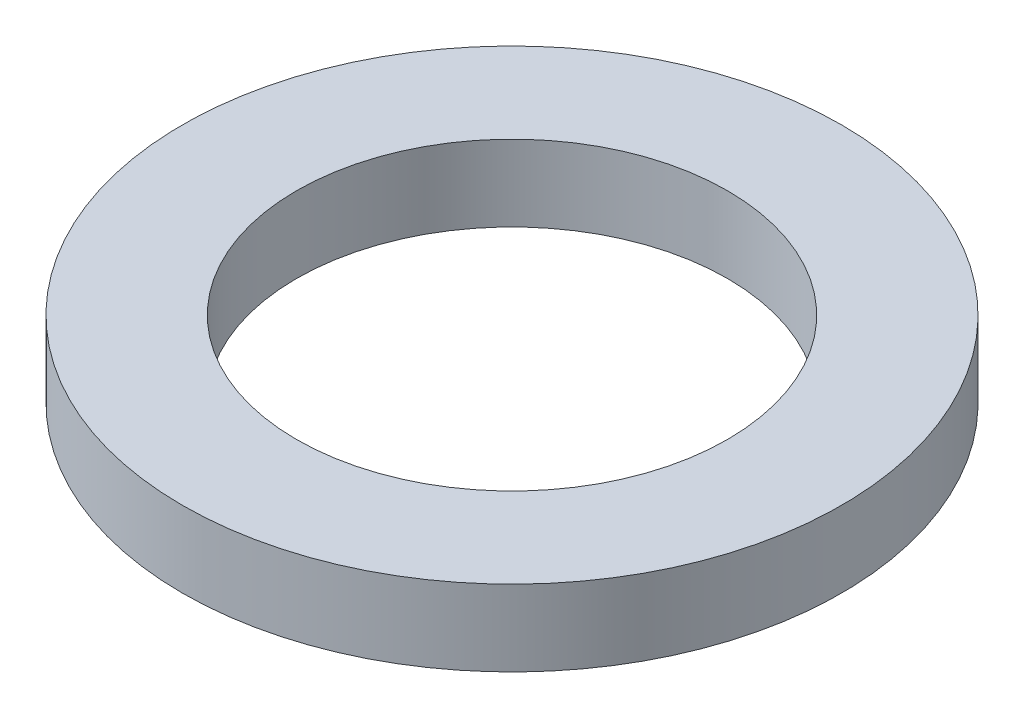
ISO-10303-21;
HEADER;
FILE_DESCRIPTION(('STEP AP214'),'2;1');
FILE_NAME('part.step','',(''),(''),'','','');
FILE_SCHEMA(('AUTOMOTIVE_DESIGN { 1 0 10303 214 1 1 1 1 }'));
ENDSEC;
DATA;
#1=APPLICATION_CONTEXT('core data for automotive mechanical design processes');
#2=APPLICATION_PROTOCOL_DEFINITION('international standard','automotive_design',2000,#1);
#3=PRODUCT_CONTEXT('',#1,'mechanical');
#4=PRODUCT('Part','Part','',(#3));
#5=PRODUCT_RELATED_PRODUCT_CATEGORY('part','',(#4));
#6=PRODUCT_DEFINITION_FORMATION('','',#4);
#7=PRODUCT_DEFINITION_CONTEXT('part definition',#1,'design');
#8=PRODUCT_DEFINITION('design','',#6,#7);
#9=PRODUCT_DEFINITION_SHAPE('','',#8);
#10=(LENGTH_UNIT() NAMED_UNIT(*) SI_UNIT(.MILLI.,.METRE.));
#11=(NAMED_UNIT(*) PLANE_ANGLE_UNIT() SI_UNIT($,.RADIAN.));
#12=(NAMED_UNIT(*) SI_UNIT($,.STERADIAN.) SOLID_ANGLE_UNIT());
#13=UNCERTAINTY_MEASURE_WITH_UNIT(LENGTH_MEASURE(1.E-05),#10,'distance_accuracy_value','');
#14=(GEOMETRIC_REPRESENTATION_CONTEXT(3) GLOBAL_UNCERTAINTY_ASSIGNED_CONTEXT((#13)) GLOBAL_UNIT_ASSIGNED_CONTEXT((#10,
#11,#12)) REPRESENTATION_CONTEXT('',''));
#15=CARTESIAN_POINT('',(0.,0.,0.));
#16=DIRECTION('',(0.,0.,1.));
#17=DIRECTION('',(1.,0.,0.));
#18=AXIS2_PLACEMENT_3D('',#15,#16,#17);
#19=CARTESIAN_POINT('',(0.,15.,0.));
#20=DIRECTION('',(0.,-1.,0.));
#21=DIRECTION('',(0.,0.,-1.));
#22=AXIS2_PLACEMENT_3D('',#19,#20,#21);
#23=CYLINDRICAL_SURFACE('',#22,65.);
#24=CARTESIAN_POINT('',(0.,15.,0.));
#25=DIRECTION('',(0.,1.,0.));
#26=DIRECTION('',(0.,0.,1.));
#27=AXIS2_PLACEMENT_3D('',#24,#25,#26);
#28=CIRCLE('',#27,65.);
#29=CARTESIAN_POINT('',(0.,15.,65.));
#30=VERTEX_POINT('',#29);
#31=EDGE_CURVE('E10',#30,#30,#28,.T.);
#32=ORIENTED_EDGE('',*,*,#31,.F.);
#33=EDGE_LOOP('',(#32));
#34=FACE_BOUND('',#33,.T.);
#35=CARTESIAN_POINT('',(0.,0.,0.));
#36=DIRECTION('',(0.,1.,0.));
#37=DIRECTION('',(0.,0.,1.));
#38=AXIS2_PLACEMENT_3D('',#35,#36,#37);
#39=CIRCLE('',#38,65.);
#40=CARTESIAN_POINT('',(0.,0.,65.));
#41=VERTEX_POINT('',#40);
#42=EDGE_CURVE('E37',#41,#41,#39,.T.);
#43=ORIENTED_EDGE('',*,*,#42,.T.);
#44=EDGE_LOOP('',(#43));
#45=FACE_BOUND('',#44,.T.);
#46=ADVANCED_FACE('F40',(#34,#45),#23,.T.);
#47=CARTESIAN_POINT('',(0.,15.,0.));
#48=DIRECTION('',(0.,1.,0.));
#49=DIRECTION('',(0.,0.,1.));
#50=AXIS2_PLACEMENT_3D('',#47,#48,#49);
#51=PLANE('',#50);
#52=CARTESIAN_POINT('',(0.,15.,0.));
#53=DIRECTION('',(0.,1.,0.));
#54=DIRECTION('',(0.,0.,1.));
#55=AXIS2_PLACEMENT_3D('',#52,#53,#54);
#56=CIRCLE('',#55,42.5);
#57=CARTESIAN_POINT('',(0.,15.,42.5));
#58=VERTEX_POINT('',#57);
#59=EDGE_CURVE('E50',#58,#58,#56,.T.);
#60=ORIENTED_EDGE('',*,*,#59,.F.);
#61=EDGE_LOOP('',(#60));
#62=FACE_BOUND('',#61,.T.);
#63=ORIENTED_EDGE('',*,*,#31,.T.);
#64=EDGE_LOOP('',(#63));
#65=FACE_BOUND('',#64,.T.);
#66=ADVANCED_FACE('F59',(#62,#65),#51,.T.);
#67=CARTESIAN_POINT('',(0.,0.,0.));
#68=DIRECTION('',(0.,1.,0.));
#69=DIRECTION('',(0.,0.,1.));
#70=AXIS2_PLACEMENT_3D('',#67,#68,#69);
#71=PLANE('',#70);
#72=CARTESIAN_POINT('',(0.,0.,0.));
#73=DIRECTION('',(0.,1.,0.));
#74=DIRECTION('',(0.,0.,1.));
#75=AXIS2_PLACEMENT_3D('',#72,#73,#74);
#76=CIRCLE('',#75,42.5);
#77=CARTESIAN_POINT('',(0.,0.,42.5));
#78=VERTEX_POINT('',#77);
#79=EDGE_CURVE('E47',#78,#78,#76,.T.);
#80=ORIENTED_EDGE('',*,*,#79,.T.);
#81=EDGE_LOOP('',(#80));
#82=FACE_BOUND('',#81,.T.);
#83=ORIENTED_EDGE('',*,*,#42,.F.);
#84=EDGE_LOOP('',(#83));
#85=FACE_BOUND('',#84,.T.);
#86=ADVANCED_FACE('F58',(#82,#85),#71,.F.);
#87=CARTESIAN_POINT('',(0.,15.,0.));
#88=DIRECTION('',(0.,-1.,0.));
#89=DIRECTION('',(0.,0.,-1.));
#90=AXIS2_PLACEMENT_3D('',#87,#88,#89);
#91=CYLINDRICAL_SURFACE('',#90,42.5);
#92=ORIENTED_EDGE('',*,*,#59,.T.);
#93=EDGE_LOOP('',(#92));
#94=FACE_BOUND('',#93,.T.);
#95=ORIENTED_EDGE('',*,*,#79,.F.);
#96=EDGE_LOOP('',(#95));
#97=FACE_BOUND('',#96,.T.);
#98=ADVANCED_FACE('F54',(#94,#97),#91,.F.);
#99=CLOSED_SHELL('',(#46,#66,#86,#98));
#100=MANIFOLD_SOLID_BREP('B2',#99);
#101=ADVANCED_BREP_SHAPE_REPRESENTATION('',(#18,#100),#14);
#102=SHAPE_DEFINITION_REPRESENTATION(#9,#101);
ENDSEC;
END-ISO-10303-21;
